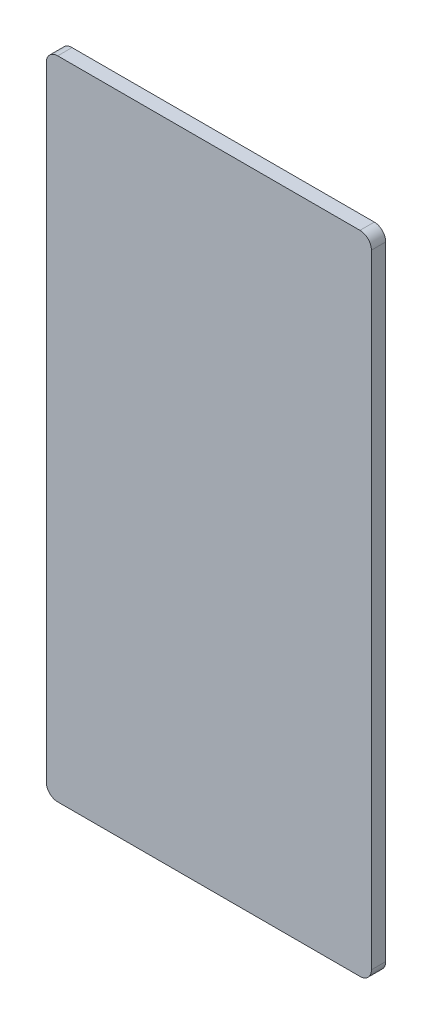
ISO-10303-21;
HEADER;
FILE_DESCRIPTION(('STEP AP214'),'2;1');
FILE_NAME('part.step','',(''),(''),'','','');
FILE_SCHEMA(('AUTOMOTIVE_DESIGN { 1 0 10303 214 1 1 1 1 }'));
ENDSEC;
DATA;
#1=APPLICATION_CONTEXT('core data for automotive mechanical design processes');
#2=APPLICATION_PROTOCOL_DEFINITION('international standard','automotive_design',2000,#1);
#3=PRODUCT_CONTEXT('',#1,'mechanical');
#4=PRODUCT('Part','Part','',(#3));
#5=PRODUCT_RELATED_PRODUCT_CATEGORY('part','',(#4));
#6=PRODUCT_DEFINITION_FORMATION('','',#4);
#7=PRODUCT_DEFINITION_CONTEXT('part definition',#1,'design');
#8=PRODUCT_DEFINITION('design','',#6,#7);
#9=PRODUCT_DEFINITION_SHAPE('','',#8);
#10=(LENGTH_UNIT() NAMED_UNIT(*) SI_UNIT(.MILLI.,.METRE.));
#11=(NAMED_UNIT(*) PLANE_ANGLE_UNIT() SI_UNIT($,.RADIAN.));
#12=(NAMED_UNIT(*) SI_UNIT($,.STERADIAN.) SOLID_ANGLE_UNIT());
#13=UNCERTAINTY_MEASURE_WITH_UNIT(LENGTH_MEASURE(1.E-05),#10,'distance_accuracy_value','');
#14=(GEOMETRIC_REPRESENTATION_CONTEXT(3) GLOBAL_UNCERTAINTY_ASSIGNED_CONTEXT((#13)) GLOBAL_UNIT_ASSIGNED_CONTEXT((#10,
#11,#12)) REPRESENTATION_CONTEXT('',''));
#15=CARTESIAN_POINT('',(0.,0.,0.));
#16=DIRECTION('',(0.,0.,1.));
#17=DIRECTION('',(1.,0.,0.));
#18=AXIS2_PLACEMENT_3D('',#15,#16,#17);
#19=CARTESIAN_POINT('',(0.,0.,3.175));
#20=DIRECTION('',(1.,0.,0.));
#21=DIRECTION('',(0.,0.,-1.));
#22=AXIS2_PLACEMENT_3D('',#19,#20,#21);
#23=PLANE('',#22);
#24=DIRECTION('',(0.,-1.,0.));
#25=VECTOR('',#24,1.);
#26=CARTESIAN_POINT('',(0.,0.,3.175));
#27=LINE('',#26,#25);
#28=CARTESIAN_POINT('',(0.,140.803173562,3.175));
#29=VERTEX_POINT('',#28);
#30=CARTESIAN_POINT('',(0.,2.54,3.175));
#31=VERTEX_POINT('',#30);
#32=EDGE_CURVE('E123',#29,#31,#27,.T.);
#33=ORIENTED_EDGE('',*,*,#32,.F.);
#34=DIRECTION('',(0.,0.,-1.));
#35=VECTOR('',#34,1.);
#36=CARTESIAN_POINT('',(0.,140.803173562,3.175));
#37=LINE('',#36,#35);
#38=CARTESIAN_POINT('',(0.,140.803173562,0.));
#39=VERTEX_POINT('',#38);
#40=EDGE_CURVE('E108',#29,#39,#37,.T.);
#41=ORIENTED_EDGE('',*,*,#40,.T.);
#42=DIRECTION('',(0.,-1.,0.));
#43=VECTOR('',#42,1.);
#44=CARTESIAN_POINT('',(0.,0.,0.));
#45=LINE('',#44,#43);
#46=CARTESIAN_POINT('',(0.,2.54,0.));
#47=VERTEX_POINT('',#46);
#48=EDGE_CURVE('E120',#39,#47,#45,.T.);
#49=ORIENTED_EDGE('',*,*,#48,.T.);
#50=DIRECTION('',(0.,0.,-1.));
#51=VECTOR('',#50,1.);
#52=CARTESIAN_POINT('',(0.,2.54,3.175));
#53=LINE('',#52,#51);
#54=EDGE_CURVE('E125',#47,#31,#53,.F.);
#55=ORIENTED_EDGE('',*,*,#54,.T.);
#56=EDGE_LOOP('',(#33,#41,#49,#55));
#57=FACE_BOUND('',#56,.T.);
#58=ADVANCED_FACE('F38',(#57),#23,.F.);
#59=CARTESIAN_POINT('',(0.,0.,3.175));
#60=DIRECTION('',(0.,1.,0.));
#61=DIRECTION('',(0.,0.,1.));
#62=AXIS2_PLACEMENT_3D('',#59,#60,#61);
#63=PLANE('',#62);
#64=DIRECTION('',(1.,0.,0.));
#65=VECTOR('',#64,1.);
#66=CARTESIAN_POINT('',(0.,0.,3.175));
#67=LINE('',#66,#65);
#68=CARTESIAN_POINT('',(2.54,0.,3.175));
#69=VERTEX_POINT('',#68);
#70=CARTESIAN_POINT('',(69.59854,0.,3.175));
#71=VERTEX_POINT('',#70);
#72=EDGE_CURVE('E165',#69,#71,#67,.T.);
#73=ORIENTED_EDGE('',*,*,#72,.F.);
#74=DIRECTION('',(0.,0.,-1.));
#75=VECTOR('',#74,1.);
#76=CARTESIAN_POINT('',(2.54,0.,3.175));
#77=LINE('',#76,#75);
#78=CARTESIAN_POINT('',(2.54,0.,0.));
#79=VERTEX_POINT('',#78);
#80=EDGE_CURVE('E158',#69,#79,#77,.T.);
#81=ORIENTED_EDGE('',*,*,#80,.T.);
#82=DIRECTION('',(1.,0.,0.));
#83=VECTOR('',#82,1.);
#84=CARTESIAN_POINT('',(0.,0.,0.));
#85=LINE('',#84,#83);
#86=CARTESIAN_POINT('',(69.59854,0.,0.));
#87=VERTEX_POINT('',#86);
#88=EDGE_CURVE('E129',#79,#87,#85,.T.);
#89=ORIENTED_EDGE('',*,*,#88,.T.);
#90=DIRECTION('',(0.,0.,-1.));
#91=VECTOR('',#90,1.);
#92=CARTESIAN_POINT('',(69.59854,0.,3.175));
#93=LINE('',#92,#91);
#94=EDGE_CURVE('E156',#87,#71,#93,.F.);
#95=ORIENTED_EDGE('',*,*,#94,.T.);
#96=EDGE_LOOP('',(#73,#81,#89,#95));
#97=FACE_BOUND('',#96,.T.);
#98=ADVANCED_FACE('F163',(#97),#63,.F.);
#99=CARTESIAN_POINT('',(72.13854,0.,3.175));
#100=DIRECTION('',(-1.,0.,0.));
#101=DIRECTION('',(0.,0.,1.));
#102=AXIS2_PLACEMENT_3D('',#99,#100,#101);
#103=PLANE('',#102);
#104=DIRECTION('',(0.,1.,0.));
#105=VECTOR('',#104,1.);
#106=CARTESIAN_POINT('',(72.13854,0.,3.175));
#107=LINE('',#106,#105);
#108=CARTESIAN_POINT('',(72.13854,2.54,3.175));
#109=VERTEX_POINT('',#108);
#110=CARTESIAN_POINT('',(72.13854,140.803173562,3.175));
#111=VERTEX_POINT('',#110);
#112=EDGE_CURVE('E173',#109,#111,#107,.T.);
#113=ORIENTED_EDGE('',*,*,#112,.F.);
#114=DIRECTION('',(0.,0.,-1.));
#115=VECTOR('',#114,1.);
#116=CARTESIAN_POINT('',(72.13854,2.54,3.175));
#117=LINE('',#116,#115);
#118=CARTESIAN_POINT('',(72.13854,2.54,0.));
#119=VERTEX_POINT('',#118);
#120=EDGE_CURVE('E11',#109,#119,#117,.T.);
#121=ORIENTED_EDGE('',*,*,#120,.T.);
#122=DIRECTION('',(0.,1.,0.));
#123=VECTOR('',#122,1.);
#124=CARTESIAN_POINT('',(72.13854,0.,0.));
#125=LINE('',#124,#123);
#126=CARTESIAN_POINT('',(72.13854,140.803173562,0.));
#127=VERTEX_POINT('',#126);
#128=EDGE_CURVE('E132',#119,#127,#125,.T.);
#129=ORIENTED_EDGE('',*,*,#128,.T.);
#130=DIRECTION('',(0.,0.,-1.));
#131=VECTOR('',#130,1.);
#132=CARTESIAN_POINT('',(72.13854,140.803173562,3.175));
#133=LINE('',#132,#131);
#134=EDGE_CURVE('E46',#127,#111,#133,.F.);
#135=ORIENTED_EDGE('',*,*,#134,.T.);
#136=EDGE_LOOP('',(#113,#121,#129,#135));
#137=FACE_BOUND('',#136,.T.);
#138=ADVANCED_FACE('F172',(#137),#103,.F.);
#139=CARTESIAN_POINT('',(0.,143.343173562,3.175));
#140=DIRECTION('',(0.,-1.,0.));
#141=DIRECTION('',(0.,0.,-1.));
#142=AXIS2_PLACEMENT_3D('',#139,#140,#141);
#143=PLANE('',#142);
#144=DIRECTION('',(-1.,0.,0.));
#145=VECTOR('',#144,1.);
#146=CARTESIAN_POINT('',(0.,143.343173562,0.));
#147=LINE('',#146,#145);
#148=CARTESIAN_POINT('',(69.59854,143.343173562,0.));
#149=VERTEX_POINT('',#148);
#150=CARTESIAN_POINT('',(2.54,143.343173562,0.));
#151=VERTEX_POINT('',#150);
#152=EDGE_CURVE('E139',#149,#151,#147,.T.);
#153=ORIENTED_EDGE('',*,*,#152,.T.);
#154=DIRECTION('',(0.,0.,-1.));
#155=VECTOR('',#154,1.);
#156=CARTESIAN_POINT('',(2.54,143.343173562,3.175));
#157=LINE('',#156,#155);
#158=CARTESIAN_POINT('',(2.54,143.343173562,3.175));
#159=VERTEX_POINT('',#158);
#160=EDGE_CURVE('E109',#151,#159,#157,.F.);
#161=ORIENTED_EDGE('',*,*,#160,.T.);
#162=DIRECTION('',(-1.,0.,0.));
#163=VECTOR('',#162,1.);
#164=CARTESIAN_POINT('',(0.,143.343173562,3.175));
#165=LINE('',#164,#163);
#166=CARTESIAN_POINT('',(69.59854,143.343173562,3.175));
#167=VERTEX_POINT('',#166);
#168=EDGE_CURVE('E135',#167,#159,#165,.T.);
#169=ORIENTED_EDGE('',*,*,#168,.F.);
#170=DIRECTION('',(0.,0.,-1.));
#171=VECTOR('',#170,1.);
#172=CARTESIAN_POINT('',(69.59854,143.343173562,3.175));
#173=LINE('',#172,#171);
#174=EDGE_CURVE('E114',#167,#149,#173,.T.);
#175=ORIENTED_EDGE('',*,*,#174,.T.);
#176=EDGE_LOOP('',(#153,#161,#169,#175));
#177=FACE_BOUND('',#176,.T.);
#178=ADVANCED_FACE('F196',(#177),#143,.F.);
#179=CARTESIAN_POINT('',(0.,0.,3.175));
#180=DIRECTION('',(0.,0.,-1.));
#181=DIRECTION('',(-1.,0.,0.));
#182=AXIS2_PLACEMENT_3D('',#179,#180,#181);
#183=PLANE('',#182);
#184=ORIENTED_EDGE('',*,*,#168,.T.);
#185=CARTESIAN_POINT('',(2.54,140.803173562,3.175));
#186=DIRECTION('',(0.,0.,-1.));
#187=DIRECTION('',(-1.,0.,0.));
#188=AXIS2_PLACEMENT_3D('',#185,#186,#187);
#189=CIRCLE('',#188,2.54);
#190=EDGE_CURVE('E154',#159,#29,#189,.F.);
#191=ORIENTED_EDGE('',*,*,#190,.T.);
#192=ORIENTED_EDGE('',*,*,#32,.T.);
#193=CARTESIAN_POINT('',(2.54,2.54,3.175));
#194=DIRECTION('',(0.,0.,-1.));
#195=DIRECTION('',(-1.,0.,0.));
#196=AXIS2_PLACEMENT_3D('',#193,#194,#195);
#197=CIRCLE('',#196,2.54);
#198=EDGE_CURVE('E152',#31,#69,#197,.F.);
#199=ORIENTED_EDGE('',*,*,#198,.T.);
#200=ORIENTED_EDGE('',*,*,#72,.T.);
#201=CARTESIAN_POINT('',(69.59854,2.54,3.175));
#202=DIRECTION('',(0.,0.,-1.));
#203=DIRECTION('',(-1.,0.,0.));
#204=AXIS2_PLACEMENT_3D('',#201,#202,#203);
#205=CIRCLE('',#204,2.54);
#206=EDGE_CURVE('E59',#71,#109,#205,.F.);
#207=ORIENTED_EDGE('',*,*,#206,.T.);
#208=ORIENTED_EDGE('',*,*,#112,.T.);
#209=CARTESIAN_POINT('',(69.59854,140.803173562,3.175));
#210=DIRECTION('',(0.,0.,-1.));
#211=DIRECTION('',(-1.,0.,0.));
#212=AXIS2_PLACEMENT_3D('',#209,#210,#211);
#213=CIRCLE('',#212,2.54);
#214=EDGE_CURVE('E149',#111,#167,#213,.F.);
#215=ORIENTED_EDGE('',*,*,#214,.T.);
#216=EDGE_LOOP('',(#184,#191,#192,#199,#200,#207,#208,#215));
#217=FACE_BOUND('',#216,.T.);
#218=ADVANCED_FACE('F178',(#217),#183,.F.);
#219=CARTESIAN_POINT('',(0.,0.,0.));
#220=DIRECTION('',(0.,0.,-1.));
#221=DIRECTION('',(-1.,0.,0.));
#222=AXIS2_PLACEMENT_3D('',#219,#220,#221);
#223=PLANE('',#222);
#224=ORIENTED_EDGE('',*,*,#48,.F.);
#225=CARTESIAN_POINT('',(2.54,140.803173562,0.));
#226=DIRECTION('',(0.,0.,-1.));
#227=DIRECTION('',(-1.,0.,0.));
#228=AXIS2_PLACEMENT_3D('',#225,#226,#227);
#229=CIRCLE('',#228,2.54);
#230=EDGE_CURVE('E104',#39,#151,#229,.T.);
#231=ORIENTED_EDGE('',*,*,#230,.T.);
#232=ORIENTED_EDGE('',*,*,#152,.F.);
#233=CARTESIAN_POINT('',(69.59854,140.803173562,0.));
#234=DIRECTION('',(0.,0.,-1.));
#235=DIRECTION('',(-1.,0.,0.));
#236=AXIS2_PLACEMENT_3D('',#233,#234,#235);
#237=CIRCLE('',#236,2.54);
#238=EDGE_CURVE('E124',#149,#127,#237,.T.);
#239=ORIENTED_EDGE('',*,*,#238,.T.);
#240=ORIENTED_EDGE('',*,*,#128,.F.);
#241=CARTESIAN_POINT('',(69.59854,2.54,0.));
#242=DIRECTION('',(0.,0.,-1.));
#243=DIRECTION('',(-1.,0.,0.));
#244=AXIS2_PLACEMENT_3D('',#241,#242,#243);
#245=CIRCLE('',#244,2.54);
#246=EDGE_CURVE('E143',#119,#87,#245,.T.);
#247=ORIENTED_EDGE('',*,*,#246,.T.);
#248=ORIENTED_EDGE('',*,*,#88,.F.);
#249=CARTESIAN_POINT('',(2.54,2.54,0.));
#250=DIRECTION('',(0.,0.,-1.));
#251=DIRECTION('',(-1.,0.,0.));
#252=AXIS2_PLACEMENT_3D('',#249,#250,#251);
#253=CIRCLE('',#252,2.54);
#254=EDGE_CURVE('E115',#79,#47,#253,.T.);
#255=ORIENTED_EDGE('',*,*,#254,.T.);
#256=EDGE_LOOP('',(#224,#231,#232,#239,#240,#247,#248,#255));
#257=FACE_BOUND('',#256,.T.);
#258=ADVANCED_FACE('F127',(#257),#223,.T.);
#259=CARTESIAN_POINT('',(2.54,140.803173562,3.175));
#260=DIRECTION('',(0.,0.,-1.));
#261=DIRECTION('',(-1.,0.,0.));
#262=AXIS2_PLACEMENT_3D('',#259,#260,#261);
#263=CYLINDRICAL_SURFACE('',#262,2.54);
#264=ORIENTED_EDGE('',*,*,#190,.F.);
#265=ORIENTED_EDGE('',*,*,#160,.F.);
#266=ORIENTED_EDGE('',*,*,#230,.F.);
#267=ORIENTED_EDGE('',*,*,#40,.F.);
#268=EDGE_LOOP('',(#264,#265,#266,#267));
#269=FACE_BOUND('',#268,.T.);
#270=ADVANCED_FACE('F107',(#269),#263,.T.);
#271=CARTESIAN_POINT('',(2.54,2.54,3.175));
#272=DIRECTION('',(0.,0.,-1.));
#273=DIRECTION('',(-1.,0.,0.));
#274=AXIS2_PLACEMENT_3D('',#271,#272,#273);
#275=CYLINDRICAL_SURFACE('',#274,2.54);
#276=ORIENTED_EDGE('',*,*,#198,.F.);
#277=ORIENTED_EDGE('',*,*,#54,.F.);
#278=ORIENTED_EDGE('',*,*,#254,.F.);
#279=ORIENTED_EDGE('',*,*,#80,.F.);
#280=EDGE_LOOP('',(#276,#277,#278,#279));
#281=FACE_BOUND('',#280,.T.);
#282=ADVANCED_FACE('F179',(#281),#275,.T.);
#283=CARTESIAN_POINT('',(69.59854,2.54,3.175));
#284=DIRECTION('',(0.,0.,-1.));
#285=DIRECTION('',(-1.,0.,0.));
#286=AXIS2_PLACEMENT_3D('',#283,#284,#285);
#287=CYLINDRICAL_SURFACE('',#286,2.54);
#288=ORIENTED_EDGE('',*,*,#206,.F.);
#289=ORIENTED_EDGE('',*,*,#94,.F.);
#290=ORIENTED_EDGE('',*,*,#246,.F.);
#291=ORIENTED_EDGE('',*,*,#120,.F.);
#292=EDGE_LOOP('',(#288,#289,#290,#291));
#293=FACE_BOUND('',#292,.T.);
#294=ADVANCED_FACE('F171',(#293),#287,.T.);
#295=CARTESIAN_POINT('',(69.59854,140.803173562,3.175));
#296=DIRECTION('',(0.,0.,-1.));
#297=DIRECTION('',(-1.,0.,0.));
#298=AXIS2_PLACEMENT_3D('',#295,#296,#297);
#299=CYLINDRICAL_SURFACE('',#298,2.54);
#300=ORIENTED_EDGE('',*,*,#214,.F.);
#301=ORIENTED_EDGE('',*,*,#134,.F.);
#302=ORIENTED_EDGE('',*,*,#238,.F.);
#303=ORIENTED_EDGE('',*,*,#174,.F.);
#304=EDGE_LOOP('',(#300,#301,#302,#303));
#305=FACE_BOUND('',#304,.T.);
#306=ADVANCED_FACE('F40',(#305),#299,.T.);
#307=CLOSED_SHELL('',(#58,#98,#138,#178,#218,#258,#270,#282,#294,#306));
#308=MANIFOLD_SOLID_BREP('B2',#307);
#309=ADVANCED_BREP_SHAPE_REPRESENTATION('',(#18,#308),#14);
#310=SHAPE_DEFINITION_REPRESENTATION(#9,#309);
ENDSEC;
END-ISO-10303-21;
